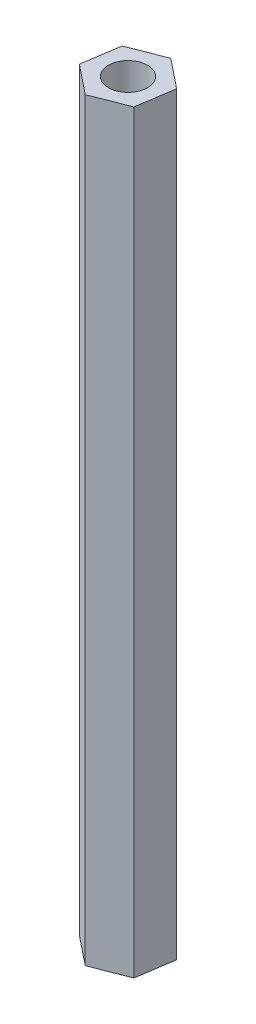
ISO-10303-21;
HEADER;
FILE_DESCRIPTION(('STEP AP214'),'2;1');
FILE_NAME('part.step','',(''),(''),'','','');
FILE_SCHEMA(('AUTOMOTIVE_DESIGN { 1 0 10303 214 1 1 1 1 }'));
ENDSEC;
DATA;
#1=APPLICATION_CONTEXT('core data for automotive mechanical design processes');
#2=APPLICATION_PROTOCOL_DEFINITION('international standard','automotive_design',2000,#1);
#3=PRODUCT_CONTEXT('',#1,'mechanical');
#4=PRODUCT('Part','Part','',(#3));
#5=PRODUCT_RELATED_PRODUCT_CATEGORY('part','',(#4));
#6=PRODUCT_DEFINITION_FORMATION('','',#4);
#7=PRODUCT_DEFINITION_CONTEXT('part definition',#1,'design');
#8=PRODUCT_DEFINITION('design','',#6,#7);
#9=PRODUCT_DEFINITION_SHAPE('','',#8);
#10=(LENGTH_UNIT() NAMED_UNIT(*) SI_UNIT(.MILLI.,.METRE.));
#11=(NAMED_UNIT(*) PLANE_ANGLE_UNIT() SI_UNIT($,.RADIAN.));
#12=(NAMED_UNIT(*) SI_UNIT($,.STERADIAN.) SOLID_ANGLE_UNIT());
#13=UNCERTAINTY_MEASURE_WITH_UNIT(LENGTH_MEASURE(1.E-05),#10,'distance_accuracy_value','');
#14=(GEOMETRIC_REPRESENTATION_CONTEXT(3) GLOBAL_UNCERTAINTY_ASSIGNED_CONTEXT((#13)) GLOBAL_UNIT_ASSIGNED_CONTEXT((#10,
#11,#12)) REPRESENTATION_CONTEXT('',''));
#15=CARTESIAN_POINT('',(0.,0.,0.));
#16=DIRECTION('',(0.,0.,1.));
#17=DIRECTION('',(1.,0.,0.));
#18=AXIS2_PLACEMENT_3D('',#15,#16,#17);
#19=CARTESIAN_POINT('',(0.,58.,0.));
#20=DIRECTION('',(0.,1.,0.));
#21=DIRECTION('',(0.,0.,1.));
#22=AXIS2_PLACEMENT_3D('',#19,#20,#21);
#23=PLANE('',#22);
#24=DIRECTION('',(0.931436185521971,0.,-0.36390470222337));
#25=VECTOR('',#24,1.);
#26=CARTESIAN_POINT('',(-0.434650575551744,58.,2.85384165827501));
#27=LINE('',#26,#25);
#28=CARTESIAN_POINT('',(-0.434650575551744,58.,2.85384165827501));
#29=VERTEX_POINT('',#28);
#30=CARTESIAN_POINT('',(2.2541740866686,58.,1.80333926933485));
#31=VERTEX_POINT('',#30);
#32=EDGE_CURVE('E136',#29,#31,#27,.T.);
#33=ORIENTED_EDGE('',*,*,#32,.T.);
#34=DIRECTION('',(0.150567376078936,0.,-0.988599749777788));
#35=VECTOR('',#34,1.);
#36=CARTESIAN_POINT('',(2.2541740866686,58.,1.80333926933485));
#37=LINE('',#36,#35);
#38=CARTESIAN_POINT('',(2.68882466222034,58.,-1.05050238894017));
#39=VERTEX_POINT('',#38);
#40=EDGE_CURVE('E94',#31,#39,#37,.T.);
#41=ORIENTED_EDGE('',*,*,#40,.T.);
#42=DIRECTION('',(-0.780868809443035,0.,-0.624695047554418));
#43=VECTOR('',#42,1.);
#44=CARTESIAN_POINT('',(2.68882466222034,58.,-1.05050238894017));
#45=LINE('',#44,#43);
#46=CARTESIAN_POINT('',(0.434650575551747,58.,-2.85384165827501));
#47=VERTEX_POINT('',#46);
#48=EDGE_CURVE('E107',#39,#47,#45,.T.);
#49=ORIENTED_EDGE('',*,*,#48,.T.);
#50=DIRECTION('',(-0.931436185521971,0.,0.36390470222337));
#51=VECTOR('',#50,1.);
#52=CARTESIAN_POINT('',(0.434650575551747,58.,-2.85384165827501));
#53=LINE('',#52,#51);
#54=CARTESIAN_POINT('',(-2.2541740866686,58.,-1.80333926933485));
#55=VERTEX_POINT('',#54);
#56=EDGE_CURVE('E101',#47,#55,#53,.T.);
#57=ORIENTED_EDGE('',*,*,#56,.T.);
#58=DIRECTION('',(-0.150567376078936,0.,0.988599749777788));
#59=VECTOR('',#58,1.);
#60=CARTESIAN_POINT('',(-2.2541740866686,58.,-1.80333926933485));
#61=LINE('',#60,#59);
#62=CARTESIAN_POINT('',(-2.68882466222034,58.,1.05050238894017));
#63=VERTEX_POINT('',#62);
#64=EDGE_CURVE('E105',#55,#63,#61,.T.);
#65=ORIENTED_EDGE('',*,*,#64,.T.);
#66=DIRECTION('',(0.780868809443036,0.,0.624695047554418));
#67=VECTOR('',#66,1.);
#68=CARTESIAN_POINT('',(-2.68882466222034,58.,1.05050238894017));
#69=LINE('',#68,#67);
#70=EDGE_CURVE('E57',#63,#29,#69,.T.);
#71=ORIENTED_EDGE('',*,*,#70,.T.);
#72=EDGE_LOOP('',(#33,#41,#49,#57,#65,#71));
#73=FACE_BOUND('',#72,.T.);
#74=CARTESIAN_POINT('',(0.,58.,0.));
#75=DIRECTION('',(0.,1.,0.));
#76=DIRECTION('',(0.,0.,1.));
#77=AXIS2_PLACEMENT_3D('',#74,#75,#76);
#78=CIRCLE('',#77,1.5);
#79=CARTESIAN_POINT('',(0.,58.,1.5));
#80=VERTEX_POINT('',#79);
#81=EDGE_CURVE('E129',#80,#80,#78,.T.);
#82=ORIENTED_EDGE('',*,*,#81,.F.);
#83=EDGE_LOOP('',(#82));
#84=FACE_BOUND('',#83,.T.);
#85=ADVANCED_FACE('F40',(#73,#84),#23,.T.);
#86=CARTESIAN_POINT('',(0.,0.,0.));
#87=DIRECTION('',(0.,1.,0.));
#88=DIRECTION('',(0.,0.,1.));
#89=AXIS2_PLACEMENT_3D('',#86,#87,#88);
#90=PLANE('',#89);
#91=DIRECTION('',(0.931436185521971,0.,-0.36390470222337));
#92=VECTOR('',#91,1.);
#93=CARTESIAN_POINT('',(-0.434650575551744,0.,2.85384165827501));
#94=LINE('',#93,#92);
#95=CARTESIAN_POINT('',(-0.434650575551744,0.,2.85384165827501));
#96=VERTEX_POINT('',#95);
#97=CARTESIAN_POINT('',(2.2541740866686,0.,1.80333926933485));
#98=VERTEX_POINT('',#97);
#99=EDGE_CURVE('E125',#96,#98,#94,.T.);
#100=ORIENTED_EDGE('',*,*,#99,.F.);
#101=DIRECTION('',(0.780868809443036,0.,0.624695047554418));
#102=VECTOR('',#101,1.);
#103=CARTESIAN_POINT('',(-2.68882466222034,0.,1.05050238894017));
#104=LINE('',#103,#102);
#105=CARTESIAN_POINT('',(-2.68882466222034,0.,1.05050238894017));
#106=VERTEX_POINT('',#105);
#107=EDGE_CURVE('E86',#106,#96,#104,.T.);
#108=ORIENTED_EDGE('',*,*,#107,.F.);
#109=DIRECTION('',(-0.150567376078936,0.,0.988599749777788));
#110=VECTOR('',#109,1.);
#111=CARTESIAN_POINT('',(-2.2541740866686,0.,-1.80333926933485));
#112=LINE('',#111,#110);
#113=CARTESIAN_POINT('',(-2.2541740866686,0.,-1.80333926933485));
#114=VERTEX_POINT('',#113);
#115=EDGE_CURVE('E80',#114,#106,#112,.T.);
#116=ORIENTED_EDGE('',*,*,#115,.F.);
#117=DIRECTION('',(-0.931436185521971,0.,0.36390470222337));
#118=VECTOR('',#117,1.);
#119=CARTESIAN_POINT('',(0.434650575551747,0.,-2.85384165827501));
#120=LINE('',#119,#118);
#121=CARTESIAN_POINT('',(0.434650575551747,0.,-2.85384165827501));
#122=VERTEX_POINT('',#121);
#123=EDGE_CURVE('E115',#122,#114,#120,.T.);
#124=ORIENTED_EDGE('',*,*,#123,.F.);
#125=DIRECTION('',(-0.780868809443035,0.,-0.624695047554418));
#126=VECTOR('',#125,1.);
#127=CARTESIAN_POINT('',(2.68882466222034,0.,-1.05050238894017));
#128=LINE('',#127,#126);
#129=CARTESIAN_POINT('',(2.68882466222034,0.,-1.05050238894017));
#130=VERTEX_POINT('',#129);
#131=EDGE_CURVE('E131',#130,#122,#128,.T.);
#132=ORIENTED_EDGE('',*,*,#131,.F.);
#133=DIRECTION('',(0.150567376078936,0.,-0.988599749777788));
#134=VECTOR('',#133,1.);
#135=CARTESIAN_POINT('',(2.2541740866686,0.,1.80333926933485));
#136=LINE('',#135,#134);
#137=EDGE_CURVE('E128',#98,#130,#136,.T.);
#138=ORIENTED_EDGE('',*,*,#137,.F.);
#139=EDGE_LOOP('',(#100,#108,#116,#124,#132,#138));
#140=FACE_BOUND('',#139,.T.);
#141=CARTESIAN_POINT('',(0.,0.,0.));
#142=DIRECTION('',(0.,1.,0.));
#143=DIRECTION('',(0.,0.,1.));
#144=AXIS2_PLACEMENT_3D('',#141,#142,#143);
#145=CIRCLE('',#144,1.5);
#146=CARTESIAN_POINT('',(0.,0.,1.5));
#147=VERTEX_POINT('',#146);
#148=EDGE_CURVE('E247',#147,#147,#145,.T.);
#149=ORIENTED_EDGE('',*,*,#148,.T.);
#150=EDGE_LOOP('',(#149));
#151=FACE_BOUND('',#150,.T.);
#152=ADVANCED_FACE('F145',(#140,#151),#90,.F.);
#153=CARTESIAN_POINT('',(-0.434650575551744,58.,2.85384165827501));
#154=DIRECTION('',(-0.36390470222337,0.,-0.931436185521971));
#155=DIRECTION('',(-0.931436185521972,0.,0.36390470222337));
#156=AXIS2_PLACEMENT_3D('',#153,#154,#155);
#157=PLANE('',#156);
#158=ORIENTED_EDGE('',*,*,#99,.T.);
#159=DIRECTION('',(0.,-1.,0.));
#160=VECTOR('',#159,1.);
#161=CARTESIAN_POINT('',(2.2541740866686,58.,1.80333926933485));
#162=LINE('',#161,#160);
#163=EDGE_CURVE('E11',#31,#98,#162,.T.);
#164=ORIENTED_EDGE('',*,*,#163,.F.);
#165=ORIENTED_EDGE('',*,*,#32,.F.);
#166=DIRECTION('',(0.,-1.,0.));
#167=VECTOR('',#166,1.);
#168=CARTESIAN_POINT('',(-0.434650575551744,58.,2.85384165827501));
#169=LINE('',#168,#167);
#170=EDGE_CURVE('E121',#29,#96,#169,.T.);
#171=ORIENTED_EDGE('',*,*,#170,.T.);
#172=EDGE_LOOP('',(#158,#164,#165,#171));
#173=FACE_BOUND('',#172,.T.);
#174=ADVANCED_FACE('F42',(#173),#157,.F.);
#175=CARTESIAN_POINT('',(2.2541740866686,58.,1.80333926933485));
#176=DIRECTION('',(-0.988599749777788,0.,-0.150567376078936));
#177=DIRECTION('',(-0.150567376078936,0.,0.988599749777788));
#178=AXIS2_PLACEMENT_3D('',#175,#176,#177);
#179=PLANE('',#178);
#180=ORIENTED_EDGE('',*,*,#137,.T.);
#181=DIRECTION('',(0.,-1.,0.));
#182=VECTOR('',#181,1.);
#183=CARTESIAN_POINT('',(2.68882466222034,58.,-1.05050238894017));
#184=LINE('',#183,#182);
#185=EDGE_CURVE('E49',#39,#130,#184,.T.);
#186=ORIENTED_EDGE('',*,*,#185,.F.);
#187=ORIENTED_EDGE('',*,*,#40,.F.);
#188=ORIENTED_EDGE('',*,*,#163,.T.);
#189=EDGE_LOOP('',(#180,#186,#187,#188));
#190=FACE_BOUND('',#189,.T.);
#191=ADVANCED_FACE('F170',(#190),#179,.F.);
#192=CARTESIAN_POINT('',(2.68882466222034,58.,-1.05050238894017));
#193=DIRECTION('',(-0.624695047554418,0.,0.780868809443035));
#194=DIRECTION('',(0.780868809443036,0.,0.624695047554418));
#195=AXIS2_PLACEMENT_3D('',#192,#193,#194);
#196=PLANE('',#195);
#197=ORIENTED_EDGE('',*,*,#131,.T.);
#198=DIRECTION('',(0.,-1.,0.));
#199=VECTOR('',#198,1.);
#200=CARTESIAN_POINT('',(0.434650575551747,58.,-2.85384165827501));
#201=LINE('',#200,#199);
#202=EDGE_CURVE('E116',#47,#122,#201,.T.);
#203=ORIENTED_EDGE('',*,*,#202,.F.);
#204=ORIENTED_EDGE('',*,*,#48,.F.);
#205=ORIENTED_EDGE('',*,*,#185,.T.);
#206=EDGE_LOOP('',(#197,#203,#204,#205));
#207=FACE_BOUND('',#206,.T.);
#208=ADVANCED_FACE('F142',(#207),#196,.F.);
#209=CARTESIAN_POINT('',(0.434650575551747,58.,-2.85384165827501));
#210=DIRECTION('',(0.36390470222337,0.,0.931436185521971));
#211=DIRECTION('',(0.931436185521972,0.,-0.36390470222337));
#212=AXIS2_PLACEMENT_3D('',#209,#210,#211);
#213=PLANE('',#212);
#214=ORIENTED_EDGE('',*,*,#123,.T.);
#215=DIRECTION('',(0.,-1.,0.));
#216=VECTOR('',#215,1.);
#217=CARTESIAN_POINT('',(-2.2541740866686,58.,-1.80333926933485));
#218=LINE('',#217,#216);
#219=EDGE_CURVE('E112',#55,#114,#218,.T.);
#220=ORIENTED_EDGE('',*,*,#219,.F.);
#221=ORIENTED_EDGE('',*,*,#56,.F.);
#222=ORIENTED_EDGE('',*,*,#202,.T.);
#223=EDGE_LOOP('',(#214,#220,#221,#222));
#224=FACE_BOUND('',#223,.T.);
#225=ADVANCED_FACE('F113',(#224),#213,.F.);
#226=CARTESIAN_POINT('',(-2.2541740866686,58.,-1.80333926933485));
#227=DIRECTION('',(0.988599749777788,0.,0.150567376078936));
#228=DIRECTION('',(0.150567376078936,0.,-0.988599749777788));
#229=AXIS2_PLACEMENT_3D('',#226,#227,#228);
#230=PLANE('',#229);
#231=ORIENTED_EDGE('',*,*,#115,.T.);
#232=DIRECTION('',(0.,-1.,0.));
#233=VECTOR('',#232,1.);
#234=CARTESIAN_POINT('',(-2.68882466222034,58.,1.05050238894017));
#235=LINE('',#234,#233);
#236=EDGE_CURVE('E117',#63,#106,#235,.T.);
#237=ORIENTED_EDGE('',*,*,#236,.F.);
#238=ORIENTED_EDGE('',*,*,#64,.F.);
#239=ORIENTED_EDGE('',*,*,#219,.T.);
#240=EDGE_LOOP('',(#231,#237,#238,#239));
#241=FACE_BOUND('',#240,.T.);
#242=ADVANCED_FACE('F119',(#241),#230,.F.);
#243=CARTESIAN_POINT('',(-2.68882466222034,58.,1.05050238894017));
#244=DIRECTION('',(0.624695047554418,0.,-0.780868809443036));
#245=DIRECTION('',(-0.780868809443036,0.,-0.624695047554418));
#246=AXIS2_PLACEMENT_3D('',#243,#244,#245);
#247=PLANE('',#246);
#248=ORIENTED_EDGE('',*,*,#107,.T.);
#249=ORIENTED_EDGE('',*,*,#170,.F.);
#250=ORIENTED_EDGE('',*,*,#70,.F.);
#251=ORIENTED_EDGE('',*,*,#236,.T.);
#252=EDGE_LOOP('',(#248,#249,#250,#251));
#253=FACE_BOUND('',#252,.T.);
#254=ADVANCED_FACE('F150',(#253),#247,.F.);
#255=CARTESIAN_POINT('',(0.,58.,0.));
#256=DIRECTION('',(0.,-1.,0.));
#257=DIRECTION('',(0.,0.,-1.));
#258=AXIS2_PLACEMENT_3D('',#255,#256,#257);
#259=CYLINDRICAL_SURFACE('',#258,1.5);
#260=ORIENTED_EDGE('',*,*,#81,.T.);
#261=EDGE_LOOP('',(#260));
#262=FACE_BOUND('',#261,.T.);
#263=ORIENTED_EDGE('',*,*,#148,.F.);
#264=EDGE_LOOP('',(#263));
#265=FACE_BOUND('',#264,.T.);
#266=ADVANCED_FACE('F152',(#262,#265),#259,.F.);
#267=CLOSED_SHELL('',(#85,#152,#174,#191,#208,#225,#242,#254,#266));
#268=MANIFOLD_SOLID_BREP('B2',#267);
#269=ADVANCED_BREP_SHAPE_REPRESENTATION('',(#18,#268),#14);
#270=SHAPE_DEFINITION_REPRESENTATION(#9,#269);
ENDSEC;
END-ISO-10303-21;
